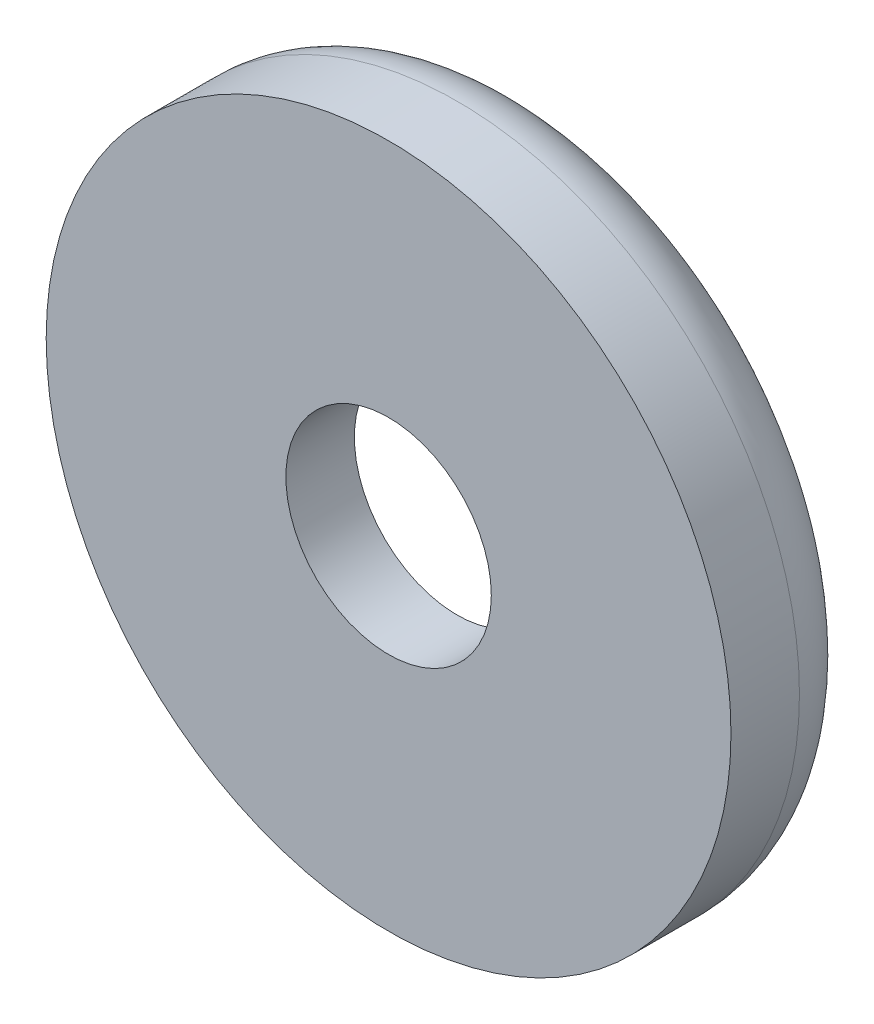
ISO-10303-21;
HEADER;
FILE_DESCRIPTION(('STEP AP214'),'2;1');
FILE_NAME('part.step','',(''),(''),'','','');
FILE_SCHEMA(('AUTOMOTIVE_DESIGN { 1 0 10303 214 1 1 1 1 }'));
ENDSEC;
DATA;
#1=APPLICATION_CONTEXT('core data for automotive mechanical design processes');
#2=APPLICATION_PROTOCOL_DEFINITION('international standard','automotive_design',2000,#1);
#3=PRODUCT_CONTEXT('',#1,'mechanical');
#4=PRODUCT('Part','Part','',(#3));
#5=PRODUCT_RELATED_PRODUCT_CATEGORY('part','',(#4));
#6=PRODUCT_DEFINITION_FORMATION('','',#4);
#7=PRODUCT_DEFINITION_CONTEXT('part definition',#1,'design');
#8=PRODUCT_DEFINITION('design','',#6,#7);
#9=PRODUCT_DEFINITION_SHAPE('','',#8);
#10=(LENGTH_UNIT() NAMED_UNIT(*) SI_UNIT(.MILLI.,.METRE.));
#11=(NAMED_UNIT(*) PLANE_ANGLE_UNIT() SI_UNIT($,.RADIAN.));
#12=(NAMED_UNIT(*) SI_UNIT($,.STERADIAN.) SOLID_ANGLE_UNIT());
#13=UNCERTAINTY_MEASURE_WITH_UNIT(LENGTH_MEASURE(1.E-05),#10,'distance_accuracy_value','');
#14=(GEOMETRIC_REPRESENTATION_CONTEXT(3) GLOBAL_UNCERTAINTY_ASSIGNED_CONTEXT((#13)) GLOBAL_UNIT_ASSIGNED_CONTEXT((#10,
#11,#12)) REPRESENTATION_CONTEXT('',''));
#15=CARTESIAN_POINT('',(0.,0.,0.));
#16=DIRECTION('',(0.,0.,1.));
#17=DIRECTION('',(1.,0.,0.));
#18=AXIS2_PLACEMENT_3D('',#15,#16,#17);
#19=CARTESIAN_POINT('',(0.,0.,2.));
#20=DIRECTION('',(0.,0.,-1.));
#21=DIRECTION('',(-1.,0.,0.));
#22=AXIS2_PLACEMENT_3D('',#19,#20,#21);
#23=CYLINDRICAL_SURFACE('',#22,5.);
#24=CARTESIAN_POINT('',(0.,0.,1.));
#25=DIRECTION('',(0.,0.,1.));
#26=DIRECTION('',(1.,0.,0.));
#27=AXIS2_PLACEMENT_3D('',#24,#25,#26);
#28=CIRCLE('',#27,5.);
#29=CARTESIAN_POINT('',(5.,0.,1.));
#30=VERTEX_POINT('',#29);
#31=EDGE_CURVE('E45',#30,#30,#28,.T.);
#32=ORIENTED_EDGE('',*,*,#31,.T.);
#33=EDGE_LOOP('',(#32));
#34=FACE_BOUND('',#33,.T.);
#35=CARTESIAN_POINT('',(0.,0.,2.));
#36=DIRECTION('',(0.,0.,1.));
#37=DIRECTION('',(1.,0.,0.));
#38=AXIS2_PLACEMENT_3D('',#35,#36,#37);
#39=CIRCLE('',#38,5.);
#40=CARTESIAN_POINT('',(5.,0.,2.));
#41=VERTEX_POINT('',#40);
#42=EDGE_CURVE('E50',#41,#41,#39,.T.);
#43=ORIENTED_EDGE('',*,*,#42,.F.);
#44=EDGE_LOOP('',(#43));
#45=FACE_BOUND('',#44,.T.);
#46=ADVANCED_FACE('F37',(#34,#45),#23,.T.);
#47=CARTESIAN_POINT('',(0.,0.,2.));
#48=DIRECTION('',(0.,0.,1.));
#49=DIRECTION('',(1.,0.,0.));
#50=AXIS2_PLACEMENT_3D('',#47,#48,#49);
#51=PLANE('',#50);
#52=CARTESIAN_POINT('',(0.,0.,2.));
#53=DIRECTION('',(0.,0.,1.));
#54=DIRECTION('',(1.,0.,0.));
#55=AXIS2_PLACEMENT_3D('',#52,#53,#54);
#56=CIRCLE('',#55,1.5);
#57=CARTESIAN_POINT('',(1.5,0.,2.));
#58=VERTEX_POINT('',#57);
#59=EDGE_CURVE('E55',#58,#58,#56,.F.);
#60=ORIENTED_EDGE('',*,*,#59,.T.);
#61=EDGE_LOOP('',(#60));
#62=FACE_BOUND('',#61,.T.);
#63=ORIENTED_EDGE('',*,*,#42,.T.);
#64=EDGE_LOOP('',(#63));
#65=FACE_BOUND('',#64,.T.);
#66=ADVANCED_FACE('F89',(#62,#65),#51,.T.);
#67=CARTESIAN_POINT('',(0.,0.,0.));
#68=DIRECTION('',(0.,0.,1.));
#69=DIRECTION('',(1.,0.,0.));
#70=AXIS2_PLACEMENT_3D('',#67,#68,#69);
#71=PLANE('',#70);
#72=CARTESIAN_POINT('',(0.,0.,0.));
#73=DIRECTION('',(0.,0.,1.));
#74=DIRECTION('',(1.,0.,0.));
#75=AXIS2_PLACEMENT_3D('',#72,#73,#74);
#76=CIRCLE('',#75,4.);
#77=CARTESIAN_POINT('',(4.,0.,0.));
#78=VERTEX_POINT('',#77);
#79=EDGE_CURVE('E10',#78,#78,#76,.F.);
#80=ORIENTED_EDGE('',*,*,#79,.T.);
#81=EDGE_LOOP('',(#80));
#82=FACE_BOUND('',#81,.T.);
#83=CARTESIAN_POINT('',(0.,0.,0.));
#84=DIRECTION('',(0.,0.,1.));
#85=DIRECTION('',(1.,0.,0.));
#86=AXIS2_PLACEMENT_3D('',#83,#84,#85);
#87=CIRCLE('',#86,3.5);
#88=CARTESIAN_POINT('',(3.5,0.,0.));
#89=VERTEX_POINT('',#88);
#90=EDGE_CURVE('E66',#89,#89,#87,.T.);
#91=ORIENTED_EDGE('',*,*,#90,.T.);
#92=EDGE_LOOP('',(#91));
#93=FACE_BOUND('',#92,.T.);
#94=ADVANCED_FACE('F93',(#82,#93),#71,.F.);
#95=CARTESIAN_POINT('',(0.,0.,13.));
#96=DIRECTION('',(0.,0.,-1.));
#97=DIRECTION('',(-1.,0.,0.));
#98=AXIS2_PLACEMENT_3D('',#95,#96,#97);
#99=CYLINDRICAL_SURFACE('',#98,1.5);
#100=CARTESIAN_POINT('',(0.,0.,1.));
#101=DIRECTION('',(0.,0.,1.));
#102=DIRECTION('',(1.,0.,0.));
#103=AXIS2_PLACEMENT_3D('',#100,#101,#102);
#104=CIRCLE('',#103,1.5);
#105=CARTESIAN_POINT('',(1.5,0.,1.));
#106=VERTEX_POINT('',#105);
#107=EDGE_CURVE('E58',#106,#106,#104,.T.);
#108=ORIENTED_EDGE('',*,*,#107,.F.);
#109=EDGE_LOOP('',(#108));
#110=FACE_BOUND('',#109,.T.);
#111=ORIENTED_EDGE('',*,*,#59,.F.);
#112=EDGE_LOOP('',(#111));
#113=FACE_BOUND('',#112,.T.);
#114=ADVANCED_FACE('F86',(#110,#113),#99,.F.);
#115=CARTESIAN_POINT('',(0.,0.,1.));
#116=DIRECTION('',(0.,0.,-1.));
#117=DIRECTION('',(-1.,0.,0.));
#118=AXIS2_PLACEMENT_3D('',#115,#116,#117);
#119=CYLINDRICAL_SURFACE('',#118,3.5);
#120=CARTESIAN_POINT('',(0.,0.,1.));
#121=DIRECTION('',(0.,0.,1.));
#122=DIRECTION('',(1.,0.,0.));
#123=AXIS2_PLACEMENT_3D('',#120,#121,#122);
#124=CIRCLE('',#123,3.5);
#125=CARTESIAN_POINT('',(3.5,0.,1.));
#126=VERTEX_POINT('',#125);
#127=EDGE_CURVE('E61',#126,#126,#124,.T.);
#128=ORIENTED_EDGE('',*,*,#127,.T.);
#129=EDGE_LOOP('',(#128));
#130=FACE_BOUND('',#129,.T.);
#131=ORIENTED_EDGE('',*,*,#90,.F.);
#132=EDGE_LOOP('',(#131));
#133=FACE_BOUND('',#132,.T.);
#134=ADVANCED_FACE('F74',(#130,#133),#119,.F.);
#135=CARTESIAN_POINT('',(0.,0.,1.));
#136=DIRECTION('',(0.,0.,1.));
#137=DIRECTION('',(1.,0.,0.));
#138=AXIS2_PLACEMENT_3D('',#135,#136,#137);
#139=PLANE('',#138);
#140=ORIENTED_EDGE('',*,*,#107,.T.);
#141=EDGE_LOOP('',(#140));
#142=FACE_BOUND('',#141,.T.);
#143=ORIENTED_EDGE('',*,*,#127,.F.);
#144=EDGE_LOOP('',(#143));
#145=FACE_BOUND('',#144,.T.);
#146=ADVANCED_FACE('F77',(#142,#145),#139,.F.);
#147=CARTESIAN_POINT('',(0.,0.,1.));
#148=DIRECTION('',(0.,0.,1.));
#149=DIRECTION('',(1.,0.,0.));
#150=AXIS2_PLACEMENT_3D('',#147,#148,#149);
#151=TOROIDAL_SURFACE('',#150,4.,1.);
#152=ORIENTED_EDGE('',*,*,#79,.F.);
#153=EDGE_LOOP('',(#152));
#154=FACE_BOUND('',#153,.T.);
#155=ORIENTED_EDGE('',*,*,#31,.F.);
#156=EDGE_LOOP('',(#155));
#157=FACE_BOUND('',#156,.T.);
#158=ADVANCED_FACE('F39',(#154,#157),#151,.T.);
#159=CLOSED_SHELL('',(#46,#66,#94,#114,#134,#146,#158));
#160=MANIFOLD_SOLID_BREP('B2',#159);
#161=ADVANCED_BREP_SHAPE_REPRESENTATION('',(#18,#160),#14);
#162=SHAPE_DEFINITION_REPRESENTATION(#9,#161);
ENDSEC;
END-ISO-10303-21;
